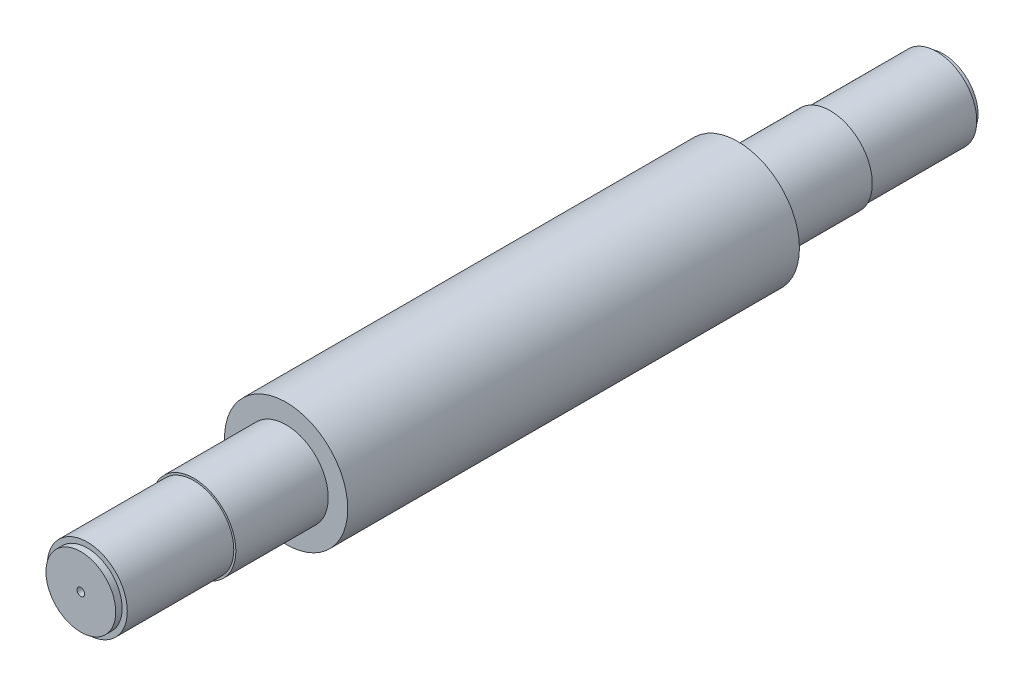
ISO-10303-21;
HEADER;
FILE_DESCRIPTION(('STEP AP214'),'2;1');
FILE_NAME('part.step','',(''),(''),'','','');
FILE_SCHEMA(('AUTOMOTIVE_DESIGN { 1 0 10303 214 1 1 1 1 }'));
ENDSEC;
DATA;
#1=APPLICATION_CONTEXT('core data for automotive mechanical design processes');
#2=APPLICATION_PROTOCOL_DEFINITION('international standard','automotive_design',2000,#1);
#3=PRODUCT_CONTEXT('',#1,'mechanical');
#4=PRODUCT('Part','Part','',(#3));
#5=PRODUCT_RELATED_PRODUCT_CATEGORY('part','',(#4));
#6=PRODUCT_DEFINITION_FORMATION('','',#4);
#7=PRODUCT_DEFINITION_CONTEXT('part definition',#1,'design');
#8=PRODUCT_DEFINITION('design','',#6,#7);
#9=PRODUCT_DEFINITION_SHAPE('','',#8);
#10=(LENGTH_UNIT() NAMED_UNIT(*) SI_UNIT(.MILLI.,.METRE.));
#11=(NAMED_UNIT(*) PLANE_ANGLE_UNIT() SI_UNIT($,.RADIAN.));
#12=(NAMED_UNIT(*) SI_UNIT($,.STERADIAN.) SOLID_ANGLE_UNIT());
#13=UNCERTAINTY_MEASURE_WITH_UNIT(LENGTH_MEASURE(1.E-05),#10,'distance_accuracy_value','');
#14=(GEOMETRIC_REPRESENTATION_CONTEXT(3) GLOBAL_UNCERTAINTY_ASSIGNED_CONTEXT((#13)) GLOBAL_UNIT_ASSIGNED_CONTEXT((#10,
#11,#12)) REPRESENTATION_CONTEXT('',''));
#15=CARTESIAN_POINT('',(0.,0.,0.));
#16=DIRECTION('',(0.,0.,1.));
#17=DIRECTION('',(1.,0.,0.));
#18=AXIS2_PLACEMENT_3D('',#15,#16,#17);
#19=CARTESIAN_POINT('',(0.,0.,440.));
#20=DIRECTION('',(0.,0.,-1.));
#21=DIRECTION('',(-1.,0.,0.));
#22=AXIS2_PLACEMENT_3D('',#19,#20,#21);
#23=CYLINDRICAL_SURFACE('',#22,60.);
#24=CARTESIAN_POINT('',(0.,0.,440.));
#25=DIRECTION('',(0.,0.,1.));
#26=DIRECTION('',(1.,0.,0.));
#27=AXIS2_PLACEMENT_3D('',#24,#25,#26);
#28=CIRCLE('',#27,60.);
#29=CARTESIAN_POINT('',(60.,0.,440.));
#30=VERTEX_POINT('',#29);
#31=EDGE_CURVE('E91',#30,#30,#28,.T.);
#32=ORIENTED_EDGE('',*,*,#31,.F.);
#33=EDGE_LOOP('',(#32));
#34=FACE_BOUND('',#33,.T.);
#35=CARTESIAN_POINT('',(0.,0.,0.));
#36=DIRECTION('',(0.,0.,1.));
#37=DIRECTION('',(1.,0.,0.));
#38=AXIS2_PLACEMENT_3D('',#35,#36,#37);
#39=CIRCLE('',#38,60.);
#40=CARTESIAN_POINT('',(60.,0.,0.));
#41=VERTEX_POINT('',#40);
#42=EDGE_CURVE('E40',#41,#41,#39,.T.);
#43=ORIENTED_EDGE('',*,*,#42,.T.);
#44=EDGE_LOOP('',(#43));
#45=FACE_BOUND('',#44,.T.);
#46=ADVANCED_FACE('F37',(#34,#45),#23,.T.);
#47=CARTESIAN_POINT('',(0.,0.,440.));
#48=DIRECTION('',(0.,0.,1.));
#49=DIRECTION('',(1.,0.,0.));
#50=AXIS2_PLACEMENT_3D('',#47,#48,#49);
#51=PLANE('',#50);
#52=CARTESIAN_POINT('',(0.,0.,440.));
#53=DIRECTION('',(0.,0.,1.));
#54=DIRECTION('',(1.,0.,0.));
#55=AXIS2_PLACEMENT_3D('',#52,#53,#54);
#56=CIRCLE('',#55,41.);
#57=CARTESIAN_POINT('',(41.,0.,440.));
#58=VERTEX_POINT('',#57);
#59=EDGE_CURVE('E77',#58,#58,#56,.T.);
#60=ORIENTED_EDGE('',*,*,#59,.F.);
#61=EDGE_LOOP('',(#60));
#62=FACE_BOUND('',#61,.T.);
#63=ORIENTED_EDGE('',*,*,#31,.T.);
#64=EDGE_LOOP('',(#63));
#65=FACE_BOUND('',#64,.T.);
#66=ADVANCED_FACE('F104',(#62,#65),#51,.T.);
#67=CARTESIAN_POINT('',(0.,0.,0.));
#68=DIRECTION('',(0.,0.,1.));
#69=DIRECTION('',(1.,0.,0.));
#70=AXIS2_PLACEMENT_3D('',#67,#68,#69);
#71=PLANE('',#70);
#72=CARTESIAN_POINT('',(0.,0.,0.));
#73=DIRECTION('',(0.,0.,-1.));
#74=DIRECTION('',(-1.,0.,0.));
#75=AXIS2_PLACEMENT_3D('',#72,#73,#74);
#76=CIRCLE('',#75,41.);
#77=CARTESIAN_POINT('',(-41.,0.,0.));
#78=VERTEX_POINT('',#77);
#79=EDGE_CURVE('E85',#78,#78,#76,.T.);
#80=ORIENTED_EDGE('',*,*,#79,.F.);
#81=EDGE_LOOP('',(#80));
#82=FACE_BOUND('',#81,.T.);
#83=ORIENTED_EDGE('',*,*,#42,.F.);
#84=EDGE_LOOP('',(#83));
#85=FACE_BOUND('',#84,.T.);
#86=ADVANCED_FACE('F101',(#82,#85),#71,.F.);
#87=CARTESIAN_POINT('',(0.,0.,-90.));
#88=DIRECTION('',(0.,0.,1.));
#89=DIRECTION('',(1.,0.,0.));
#90=AXIS2_PLACEMENT_3D('',#87,#88,#89);
#91=CYLINDRICAL_SURFACE('',#90,41.);
#92=CARTESIAN_POINT('',(0.,0.,-90.));
#93=DIRECTION('',(0.,0.,-1.));
#94=DIRECTION('',(-1.,0.,0.));
#95=AXIS2_PLACEMENT_3D('',#92,#93,#94);
#96=CIRCLE('',#95,41.);
#97=CARTESIAN_POINT('',(-41.,0.,-90.));
#98=VERTEX_POINT('',#97);
#99=EDGE_CURVE('E81',#98,#98,#96,.T.);
#100=ORIENTED_EDGE('',*,*,#99,.F.);
#101=EDGE_LOOP('',(#100));
#102=FACE_BOUND('',#101,.T.);
#103=ORIENTED_EDGE('',*,*,#79,.T.);
#104=EDGE_LOOP('',(#103));
#105=FACE_BOUND('',#104,.T.);
#106=ADVANCED_FACE('F103',(#102,#105),#91,.T.);
#107=CARTESIAN_POINT('',(0.,0.,-90.));
#108=DIRECTION('',(0.,0.,-1.));
#109=DIRECTION('',(-1.,0.,0.));
#110=AXIS2_PLACEMENT_3D('',#107,#108,#109);
#111=PLANE('',#110);
#112=CARTESIAN_POINT('',(0.,0.,-90.));
#113=DIRECTION('',(0.,0.,-1.));
#114=DIRECTION('',(-1.,0.,0.));
#115=AXIS2_PLACEMENT_3D('',#112,#113,#114);
#116=CIRCLE('',#115,39.);
#117=CARTESIAN_POINT('',(-39.,0.,-90.));
#118=VERTEX_POINT('',#117);
#119=EDGE_CURVE('E51',#118,#118,#116,.T.);
#120=ORIENTED_EDGE('',*,*,#119,.F.);
#121=EDGE_LOOP('',(#120));
#122=FACE_BOUND('',#121,.T.);
#123=ORIENTED_EDGE('',*,*,#99,.T.);
#124=EDGE_LOOP('',(#123));
#125=FACE_BOUND('',#124,.T.);
#126=ADVANCED_FACE('F110',(#122,#125),#111,.T.);
#127=CARTESIAN_POINT('',(0.,0.,530.));
#128=DIRECTION('',(0.,0.,-1.));
#129=DIRECTION('',(-1.,0.,0.));
#130=AXIS2_PLACEMENT_3D('',#127,#128,#129);
#131=CYLINDRICAL_SURFACE('',#130,41.);
#132=CARTESIAN_POINT('',(0.,0.,530.));
#133=DIRECTION('',(0.,0.,1.));
#134=DIRECTION('',(1.,0.,0.));
#135=AXIS2_PLACEMENT_3D('',#132,#133,#134);
#136=CIRCLE('',#135,41.);
#137=CARTESIAN_POINT('',(41.,0.,530.));
#138=VERTEX_POINT('',#137);
#139=EDGE_CURVE('E73',#138,#138,#136,.T.);
#140=ORIENTED_EDGE('',*,*,#139,.F.);
#141=EDGE_LOOP('',(#140));
#142=FACE_BOUND('',#141,.T.);
#143=ORIENTED_EDGE('',*,*,#59,.T.);
#144=EDGE_LOOP('',(#143));
#145=FACE_BOUND('',#144,.T.);
#146=ADVANCED_FACE('F133',(#142,#145),#131,.T.);
#147=CARTESIAN_POINT('',(0.,0.,530.));
#148=DIRECTION('',(0.,0.,1.));
#149=DIRECTION('',(1.,0.,0.));
#150=AXIS2_PLACEMENT_3D('',#147,#148,#149);
#151=PLANE('',#150);
#152=CARTESIAN_POINT('',(0.,0.,530.));
#153=DIRECTION('',(0.,0.,1.));
#154=DIRECTION('',(1.,0.,0.));
#155=AXIS2_PLACEMENT_3D('',#152,#153,#154);
#156=CIRCLE('',#155,39.);
#157=CARTESIAN_POINT('',(39.,0.,530.));
#158=VERTEX_POINT('',#157);
#159=EDGE_CURVE('E69',#158,#158,#156,.T.);
#160=ORIENTED_EDGE('',*,*,#159,.F.);
#161=EDGE_LOOP('',(#160));
#162=FACE_BOUND('',#161,.T.);
#163=ORIENTED_EDGE('',*,*,#139,.T.);
#164=EDGE_LOOP('',(#163));
#165=FACE_BOUND('',#164,.T.);
#166=ADVANCED_FACE('F138',(#162,#165),#151,.T.);
#167=CARTESIAN_POINT('',(0.,0.,633.75));
#168=DIRECTION('',(0.,0.,-1.));
#169=DIRECTION('',(-1.,0.,0.));
#170=AXIS2_PLACEMENT_3D('',#167,#168,#169);
#171=CYLINDRICAL_SURFACE('',#170,39.);
#172=CARTESIAN_POINT('',(0.,0.,633.75));
#173=DIRECTION('',(0.,0.,1.));
#174=DIRECTION('',(1.,0.,0.));
#175=AXIS2_PLACEMENT_3D('',#172,#173,#174);
#176=CIRCLE('',#175,39.);
#177=CARTESIAN_POINT('',(39.,0.,633.75));
#178=VERTEX_POINT('',#177);
#179=EDGE_CURVE('E65',#178,#178,#176,.T.);
#180=ORIENTED_EDGE('',*,*,#179,.F.);
#181=EDGE_LOOP('',(#180));
#182=FACE_BOUND('',#181,.T.);
#183=ORIENTED_EDGE('',*,*,#159,.T.);
#184=EDGE_LOOP('',(#183));
#185=FACE_BOUND('',#184,.T.);
#186=ADVANCED_FACE('F150',(#182,#185),#171,.T.);
#187=CARTESIAN_POINT('',(0.,0.,633.75));
#188=DIRECTION('',(0.,0.,1.));
#189=DIRECTION('',(1.,0.,0.));
#190=AXIS2_PLACEMENT_3D('',#187,#188,#189);
#191=PLANE('',#190);
#192=CARTESIAN_POINT('',(0.,0.,633.75));
#193=DIRECTION('',(0.,0.,1.));
#194=DIRECTION('',(1.,0.,0.));
#195=AXIS2_PLACEMENT_3D('',#192,#193,#194);
#196=CIRCLE('',#195,34.);
#197=CARTESIAN_POINT('',(34.,0.,633.75));
#198=VERTEX_POINT('',#197);
#199=EDGE_CURVE('E10',#198,#198,#196,.T.);
#200=ORIENTED_EDGE('',*,*,#199,.F.);
#201=EDGE_LOOP('',(#200));
#202=FACE_BOUND('',#201,.T.);
#203=ORIENTED_EDGE('',*,*,#179,.T.);
#204=EDGE_LOOP('',(#203));
#205=FACE_BOUND('',#204,.T.);
#206=ADVANCED_FACE('F160',(#202,#205),#191,.T.);
#207=CARTESIAN_POINT('',(0.,0.,-193.75));
#208=DIRECTION('',(0.,0.,1.));
#209=DIRECTION('',(1.,0.,0.));
#210=AXIS2_PLACEMENT_3D('',#207,#208,#209);
#211=CYLINDRICAL_SURFACE('',#210,39.);
#212=CARTESIAN_POINT('',(0.,0.,-193.75));
#213=DIRECTION('',(0.,0.,-1.));
#214=DIRECTION('',(-1.,0.,0.));
#215=AXIS2_PLACEMENT_3D('',#212,#213,#214);
#216=CIRCLE('',#215,39.);
#217=CARTESIAN_POINT('',(-39.,0.,-193.75));
#218=VERTEX_POINT('',#217);
#219=EDGE_CURVE('E60',#218,#218,#216,.T.);
#220=ORIENTED_EDGE('',*,*,#219,.F.);
#221=EDGE_LOOP('',(#220));
#222=FACE_BOUND('',#221,.T.);
#223=ORIENTED_EDGE('',*,*,#119,.T.);
#224=EDGE_LOOP('',(#223));
#225=FACE_BOUND('',#224,.T.);
#226=ADVANCED_FACE('F175',(#222,#225),#211,.T.);
#227=CARTESIAN_POINT('',(0.,0.,-193.75));
#228=DIRECTION('',(0.,0.,-1.));
#229=DIRECTION('',(-1.,0.,0.));
#230=AXIS2_PLACEMENT_3D('',#227,#228,#229);
#231=PLANE('',#230);
#232=CARTESIAN_POINT('',(0.,0.,-193.75));
#233=DIRECTION('',(0.,0.,-1.));
#234=DIRECTION('',(-1.,0.,0.));
#235=AXIS2_PLACEMENT_3D('',#232,#233,#234);
#236=CIRCLE('',#235,34.);
#237=CARTESIAN_POINT('',(-34.,0.,-193.75));
#238=VERTEX_POINT('',#237);
#239=EDGE_CURVE('E45',#238,#238,#236,.T.);
#240=ORIENTED_EDGE('',*,*,#239,.F.);
#241=EDGE_LOOP('',(#240));
#242=FACE_BOUND('',#241,.T.);
#243=ORIENTED_EDGE('',*,*,#219,.T.);
#244=EDGE_LOOP('',(#243));
#245=FACE_BOUND('',#244,.T.);
#246=ADVANCED_FACE('F180',(#242,#245),#231,.T.);
#247=CARTESIAN_POINT('',(0.,0.,-200.));
#248=DIRECTION('',(0.,0.,1.));
#249=DIRECTION('',(1.,0.,0.));
#250=AXIS2_PLACEMENT_3D('',#247,#248,#249);
#251=CYLINDRICAL_SURFACE('',#250,34.);
#252=CARTESIAN_POINT('',(0.,0.,-200.));
#253=DIRECTION('',(0.,0.,-1.));
#254=DIRECTION('',(-1.,0.,0.));
#255=AXIS2_PLACEMENT_3D('',#252,#253,#254);
#256=CIRCLE('',#255,34.);
#257=CARTESIAN_POINT('',(-34.,0.,-200.));
#258=VERTEX_POINT('',#257);
#259=EDGE_CURVE('E57',#258,#258,#256,.T.);
#260=ORIENTED_EDGE('',*,*,#259,.F.);
#261=EDGE_LOOP('',(#260));
#262=FACE_BOUND('',#261,.T.);
#263=ORIENTED_EDGE('',*,*,#239,.T.);
#264=EDGE_LOOP('',(#263));
#265=FACE_BOUND('',#264,.T.);
#266=ADVANCED_FACE('F190',(#262,#265),#251,.T.);
#267=CARTESIAN_POINT('',(0.,0.,-200.));
#268=DIRECTION('',(0.,0.,-1.));
#269=DIRECTION('',(-1.,0.,0.));
#270=AXIS2_PLACEMENT_3D('',#267,#268,#269);
#271=PLANE('',#270);
#272=CARTESIAN_POINT('',(0.,0.,-200.));
#273=DIRECTION('',(0.,0.,1.));
#274=DIRECTION('',(1.,0.,0.));
#275=AXIS2_PLACEMENT_3D('',#272,#273,#274);
#276=CIRCLE('',#275,3.75);
#277=CARTESIAN_POINT('',(3.75,0.,-200.));
#278=VERTEX_POINT('',#277);
#279=EDGE_CURVE('E254',#278,#278,#276,.T.);
#280=ORIENTED_EDGE('',*,*,#279,.T.);
#281=EDGE_LOOP('',(#280));
#282=FACE_BOUND('',#281,.T.);
#283=ORIENTED_EDGE('',*,*,#259,.T.);
#284=EDGE_LOOP('',(#283));
#285=FACE_BOUND('',#284,.T.);
#286=ADVANCED_FACE('F200',(#282,#285),#271,.T.);
#287=CARTESIAN_POINT('',(0.,0.,640.));
#288=DIRECTION('',(0.,0.,-1.));
#289=DIRECTION('',(-1.,0.,0.));
#290=AXIS2_PLACEMENT_3D('',#287,#288,#289);
#291=CYLINDRICAL_SURFACE('',#290,34.);
#292=CARTESIAN_POINT('',(0.,0.,640.));
#293=DIRECTION('',(0.,0.,1.));
#294=DIRECTION('',(1.,0.,0.));
#295=AXIS2_PLACEMENT_3D('',#292,#293,#294);
#296=CIRCLE('',#295,34.);
#297=CARTESIAN_POINT('',(34.,0.,640.));
#298=VERTEX_POINT('',#297);
#299=EDGE_CURVE('E55',#298,#298,#296,.T.);
#300=ORIENTED_EDGE('',*,*,#299,.F.);
#301=EDGE_LOOP('',(#300));
#302=FACE_BOUND('',#301,.T.);
#303=ORIENTED_EDGE('',*,*,#199,.T.);
#304=EDGE_LOOP('',(#303));
#305=FACE_BOUND('',#304,.T.);
#306=ADVANCED_FACE('F215',(#302,#305),#291,.T.);
#307=CARTESIAN_POINT('',(0.,0.,640.));
#308=DIRECTION('',(0.,0.,1.));
#309=DIRECTION('',(1.,0.,0.));
#310=AXIS2_PLACEMENT_3D('',#307,#308,#309);
#311=PLANE('',#310);
#312=CARTESIAN_POINT('',(0.,0.,640.));
#313=DIRECTION('',(0.,0.,1.));
#314=DIRECTION('',(1.,0.,0.));
#315=AXIS2_PLACEMENT_3D('',#312,#313,#314);
#316=CIRCLE('',#315,3.75);
#317=CARTESIAN_POINT('',(3.75,0.,640.));
#318=VERTEX_POINT('',#317);
#319=EDGE_CURVE('E257',#318,#318,#316,.T.);
#320=ORIENTED_EDGE('',*,*,#319,.F.);
#321=EDGE_LOOP('',(#320));
#322=FACE_BOUND('',#321,.T.);
#323=ORIENTED_EDGE('',*,*,#299,.T.);
#324=EDGE_LOOP('',(#323));
#325=FACE_BOUND('',#324,.T.);
#326=ADVANCED_FACE('F220',(#322,#325),#311,.T.);
#327=CARTESIAN_POINT('',(0.,0.,-200.));
#328=DIRECTION('',(0.,0.,1.));
#329=DIRECTION('',(1.,0.,0.));
#330=AXIS2_PLACEMENT_3D('',#327,#328,#329);
#331=CYLINDRICAL_SURFACE('',#330,3.75);
#332=ORIENTED_EDGE('',*,*,#279,.F.);
#333=EDGE_LOOP('',(#332));
#334=FACE_BOUND('',#333,.T.);
#335=ORIENTED_EDGE('',*,*,#319,.T.);
#336=EDGE_LOOP('',(#335));
#337=FACE_BOUND('',#336,.T.);
#338=ADVANCED_FACE('F237',(#334,#337),#331,.F.);
#339=CLOSED_SHELL('',(#46,#66,#86,#106,#126,#146,#166,#186,#206,#226,#246,#266,#286,#306,#326,#338));
#340=MANIFOLD_SOLID_BREP('B2',#339);
#341=ADVANCED_BREP_SHAPE_REPRESENTATION('',(#18,#340),#14);
#342=SHAPE_DEFINITION_REPRESENTATION(#9,#341);
ENDSEC;
END-ISO-10303-21;
